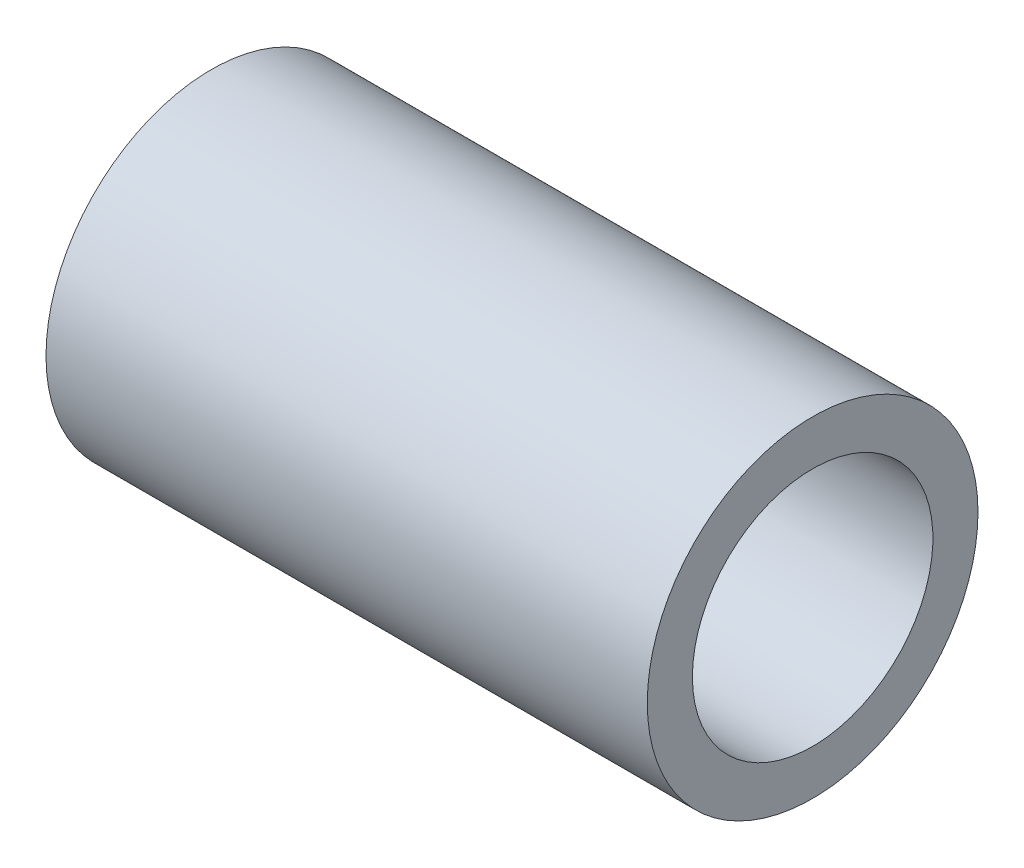
ISO-10303-21;
HEADER;
FILE_DESCRIPTION(('STEP AP214'),'2;1');
FILE_NAME('part.step','',(''),(''),'','','');
FILE_SCHEMA(('AUTOMOTIVE_DESIGN { 1 0 10303 214 1 1 1 1 }'));
ENDSEC;
DATA;
#1=APPLICATION_CONTEXT('core data for automotive mechanical design processes');
#2=APPLICATION_PROTOCOL_DEFINITION('international standard','automotive_design',2000,#1);
#3=PRODUCT_CONTEXT('',#1,'mechanical');
#4=PRODUCT('Part','Part','',(#3));
#5=PRODUCT_RELATED_PRODUCT_CATEGORY('part','',(#4));
#6=PRODUCT_DEFINITION_FORMATION('','',#4);
#7=PRODUCT_DEFINITION_CONTEXT('part definition',#1,'design');
#8=PRODUCT_DEFINITION('design','',#6,#7);
#9=PRODUCT_DEFINITION_SHAPE('','',#8);
#10=(LENGTH_UNIT() NAMED_UNIT(*) SI_UNIT(.MILLI.,.METRE.));
#11=(NAMED_UNIT(*) PLANE_ANGLE_UNIT() SI_UNIT($,.RADIAN.));
#12=(NAMED_UNIT(*) SI_UNIT($,.STERADIAN.) SOLID_ANGLE_UNIT());
#13=UNCERTAINTY_MEASURE_WITH_UNIT(LENGTH_MEASURE(1.E-05),#10,'distance_accuracy_value','');
#14=(GEOMETRIC_REPRESENTATION_CONTEXT(3) GLOBAL_UNCERTAINTY_ASSIGNED_CONTEXT((#13)) GLOBAL_UNIT_ASSIGNED_CONTEXT((#10,
#11,#12)) REPRESENTATION_CONTEXT('',''));
#15=CARTESIAN_POINT('',(0.,0.,0.));
#16=DIRECTION('',(0.,0.,1.));
#17=DIRECTION('',(1.,0.,0.));
#18=AXIS2_PLACEMENT_3D('',#15,#16,#17);
#19=CARTESIAN_POINT('',(2.,4.,0.));
#20=DIRECTION('',(1.,0.,0.));
#21=DIRECTION('',(0.,0.,-1.));
#22=AXIS2_PLACEMENT_3D('',#19,#20,#21);
#23=PLANE('',#22);
#24=CARTESIAN_POINT('',(2.,0.,0.));
#25=DIRECTION('',(-1.,0.,0.));
#26=DIRECTION('',(0.,0.,1.));
#27=AXIS2_PLACEMENT_3D('',#24,#25,#26);
#28=CIRCLE('',#27,4.);
#29=CARTESIAN_POINT('',(2.,0.,4.));
#30=VERTEX_POINT('',#29);
#31=EDGE_CURVE('E45',#30,#30,#28,.T.);
#32=ORIENTED_EDGE('',*,*,#31,.F.);
#33=EDGE_LOOP('',(#32));
#34=FACE_BOUND('',#33,.T.);
#35=CARTESIAN_POINT('',(2.,0.,0.));
#36=DIRECTION('',(-1.,0.,0.));
#37=DIRECTION('',(0.,0.,1.));
#38=AXIS2_PLACEMENT_3D('',#35,#36,#37);
#39=CIRCLE('',#38,5.5);
#40=CARTESIAN_POINT('',(2.,0.,5.5));
#41=VERTEX_POINT('',#40);
#42=EDGE_CURVE('E10',#41,#41,#39,.T.);
#43=ORIENTED_EDGE('',*,*,#42,.T.);
#44=EDGE_LOOP('',(#43));
#45=FACE_BOUND('',#44,.T.);
#46=ADVANCED_FACE('F31',(#34,#45),#23,.F.);
#47=CARTESIAN_POINT('',(0.,0.,0.));
#48=DIRECTION('',(-1.,0.,0.));
#49=DIRECTION('',(0.,0.,1.));
#50=AXIS2_PLACEMENT_3D('',#47,#48,#49);
#51=CYLINDRICAL_SURFACE('',#50,5.5);
#52=ORIENTED_EDGE('',*,*,#42,.F.);
#53=EDGE_LOOP('',(#52));
#54=FACE_BOUND('',#53,.T.);
#55=CARTESIAN_POINT('',(22.,0.,0.));
#56=DIRECTION('',(-1.,0.,0.));
#57=DIRECTION('',(0.,0.,1.));
#58=AXIS2_PLACEMENT_3D('',#55,#56,#57);
#59=CIRCLE('',#58,5.5);
#60=CARTESIAN_POINT('',(22.,0.,5.5));
#61=VERTEX_POINT('',#60);
#62=EDGE_CURVE('E37',#61,#61,#59,.T.);
#63=ORIENTED_EDGE('',*,*,#62,.T.);
#64=EDGE_LOOP('',(#63));
#65=FACE_BOUND('',#64,.T.);
#66=ADVANCED_FACE('F54',(#54,#65),#51,.T.);
#67=CARTESIAN_POINT('',(22.,4.,0.));
#68=DIRECTION('',(-1.,0.,0.));
#69=DIRECTION('',(0.,0.,1.));
#70=AXIS2_PLACEMENT_3D('',#67,#68,#69);
#71=PLANE('',#70);
#72=ORIENTED_EDGE('',*,*,#62,.F.);
#73=EDGE_LOOP('',(#72));
#74=FACE_BOUND('',#73,.T.);
#75=CARTESIAN_POINT('',(22.,0.,0.));
#76=DIRECTION('',(-1.,0.,0.));
#77=DIRECTION('',(0.,0.,1.));
#78=AXIS2_PLACEMENT_3D('',#75,#76,#77);
#79=CIRCLE('',#78,4.);
#80=CARTESIAN_POINT('',(22.,0.,4.));
#81=VERTEX_POINT('',#80);
#82=EDGE_CURVE('E41',#81,#81,#79,.T.);
#83=ORIENTED_EDGE('',*,*,#82,.T.);
#84=EDGE_LOOP('',(#83));
#85=FACE_BOUND('',#84,.T.);
#86=ADVANCED_FACE('F58',(#74,#85),#71,.F.);
#87=CARTESIAN_POINT('',(0.,0.,0.));
#88=DIRECTION('',(-1.,0.,0.));
#89=DIRECTION('',(0.,0.,1.));
#90=AXIS2_PLACEMENT_3D('',#87,#88,#89);
#91=CYLINDRICAL_SURFACE('',#90,4.);
#92=ORIENTED_EDGE('',*,*,#82,.F.);
#93=EDGE_LOOP('',(#92));
#94=FACE_BOUND('',#93,.T.);
#95=ORIENTED_EDGE('',*,*,#31,.T.);
#96=EDGE_LOOP('',(#95));
#97=FACE_BOUND('',#96,.T.);
#98=ADVANCED_FACE('F51',(#94,#97),#91,.F.);
#99=CLOSED_SHELL('',(#46,#66,#86,#98));
#100=MANIFOLD_SOLID_BREP('B2',#99);
#101=ADVANCED_BREP_SHAPE_REPRESENTATION('',(#18,#100),#14);
#102=SHAPE_DEFINITION_REPRESENTATION(#9,#101);
ENDSEC;
END-ISO-10303-21;
